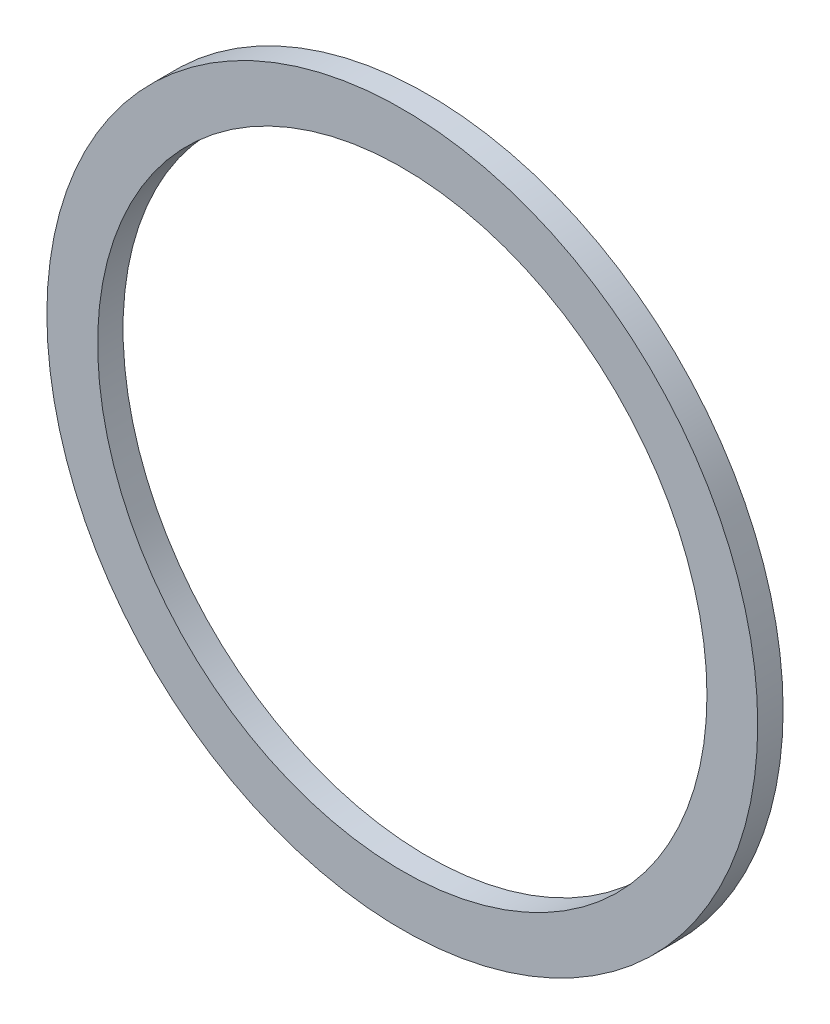
ISO-10303-21;
HEADER;
FILE_DESCRIPTION(('STEP AP214'),'2;1');
FILE_NAME('part.step','',(''),(''),'','','');
FILE_SCHEMA(('AUTOMOTIVE_DESIGN { 1 0 10303 214 1 1 1 1 }'));
ENDSEC;
DATA;
#1=APPLICATION_CONTEXT('core data for automotive mechanical design processes');
#2=APPLICATION_PROTOCOL_DEFINITION('international standard','automotive_design',2000,#1);
#3=PRODUCT_CONTEXT('',#1,'mechanical');
#4=PRODUCT('Part','Part','',(#3));
#5=PRODUCT_RELATED_PRODUCT_CATEGORY('part','',(#4));
#6=PRODUCT_DEFINITION_FORMATION('','',#4);
#7=PRODUCT_DEFINITION_CONTEXT('part definition',#1,'design');
#8=PRODUCT_DEFINITION('design','',#6,#7);
#9=PRODUCT_DEFINITION_SHAPE('','',#8);
#10=(LENGTH_UNIT() NAMED_UNIT(*) SI_UNIT(.MILLI.,.METRE.));
#11=(NAMED_UNIT(*) PLANE_ANGLE_UNIT() SI_UNIT($,.RADIAN.));
#12=(NAMED_UNIT(*) SI_UNIT($,.STERADIAN.) SOLID_ANGLE_UNIT());
#13=UNCERTAINTY_MEASURE_WITH_UNIT(LENGTH_MEASURE(1.E-05),#10,'distance_accuracy_value','');
#14=(GEOMETRIC_REPRESENTATION_CONTEXT(3) GLOBAL_UNCERTAINTY_ASSIGNED_CONTEXT((#13)) GLOBAL_UNIT_ASSIGNED_CONTEXT((#10,
#11,#12)) REPRESENTATION_CONTEXT('',''));
#15=CARTESIAN_POINT('',(0.,0.,0.));
#16=DIRECTION('',(0.,0.,1.));
#17=DIRECTION('',(1.,0.,0.));
#18=AXIS2_PLACEMENT_3D('',#15,#16,#17);
#19=CARTESIAN_POINT('',(-0.0999587239789712,0.399834895915926,2.5));
#20=DIRECTION('',(0.,0.,1.));
#21=DIRECTION('',(1.,0.,0.));
#22=AXIS2_PLACEMENT_3D('',#19,#20,#21);
#23=PLANE('',#22);
#24=CARTESIAN_POINT('',(-0.0999587239789712,0.399834895915926,2.5));
#25=DIRECTION('',(0.,0.,1.));
#26=DIRECTION('',(1.,0.,0.));
#27=AXIS2_PLACEMENT_3D('',#24,#25,#26);
#28=CIRCLE('',#27,35.);
#29=CARTESIAN_POINT('',(34.900041276021,0.399834895915926,2.5));
#30=VERTEX_POINT('',#29);
#31=EDGE_CURVE('E10',#30,#30,#28,.T.);
#32=ORIENTED_EDGE('',*,*,#31,.T.);
#33=EDGE_LOOP('',(#32));
#34=FACE_BOUND('',#33,.T.);
#35=CARTESIAN_POINT('',(-0.0999587239789712,0.399834895915926,2.5));
#36=DIRECTION('',(0.,0.,1.));
#37=DIRECTION('',(1.,0.,0.));
#38=AXIS2_PLACEMENT_3D('',#35,#36,#37);
#39=CIRCLE('',#38,30.);
#40=CARTESIAN_POINT('',(29.900041276021,0.399834895915926,2.5));
#41=VERTEX_POINT('',#40);
#42=EDGE_CURVE('E50',#41,#41,#39,.T.);
#43=ORIENTED_EDGE('',*,*,#42,.F.);
#44=EDGE_LOOP('',(#43));
#45=FACE_BOUND('',#44,.T.);
#46=ADVANCED_FACE('F37',(#34,#45),#23,.T.);
#47=CARTESIAN_POINT('',(-0.0999587239789712,0.399834895915926,0.));
#48=DIRECTION('',(0.,0.,1.));
#49=DIRECTION('',(1.,0.,0.));
#50=AXIS2_PLACEMENT_3D('',#47,#48,#49);
#51=PLANE('',#50);
#52=CARTESIAN_POINT('',(-0.0999587239789712,0.399834895915926,0.));
#53=DIRECTION('',(0.,0.,1.));
#54=DIRECTION('',(1.,0.,0.));
#55=AXIS2_PLACEMENT_3D('',#52,#53,#54);
#56=CIRCLE('',#55,35.);
#57=CARTESIAN_POINT('',(34.900041276021,0.399834895915926,0.));
#58=VERTEX_POINT('',#57);
#59=EDGE_CURVE('E41',#58,#58,#56,.T.);
#60=ORIENTED_EDGE('',*,*,#59,.F.);
#61=EDGE_LOOP('',(#60));
#62=FACE_BOUND('',#61,.T.);
#63=CARTESIAN_POINT('',(-0.0999587239789712,0.399834895915926,0.));
#64=DIRECTION('',(0.,0.,1.));
#65=DIRECTION('',(1.,0.,0.));
#66=AXIS2_PLACEMENT_3D('',#63,#64,#65);
#67=CIRCLE('',#66,30.);
#68=CARTESIAN_POINT('',(29.900041276021,0.399834895915926,0.));
#69=VERTEX_POINT('',#68);
#70=EDGE_CURVE('E52',#69,#69,#67,.T.);
#71=ORIENTED_EDGE('',*,*,#70,.T.);
#72=EDGE_LOOP('',(#71));
#73=FACE_BOUND('',#72,.T.);
#74=ADVANCED_FACE('F64',(#62,#73),#51,.F.);
#75=CARTESIAN_POINT('',(-0.0999587239789712,0.399834895915926,2.5));
#76=DIRECTION('',(0.,0.,-1.));
#77=DIRECTION('',(-1.,0.,0.));
#78=AXIS2_PLACEMENT_3D('',#75,#76,#77);
#79=CYLINDRICAL_SURFACE('',#78,35.);
#80=ORIENTED_EDGE('',*,*,#31,.F.);
#81=EDGE_LOOP('',(#80));
#82=FACE_BOUND('',#81,.T.);
#83=ORIENTED_EDGE('',*,*,#59,.T.);
#84=EDGE_LOOP('',(#83));
#85=FACE_BOUND('',#84,.T.);
#86=ADVANCED_FACE('F39',(#82,#85),#79,.T.);
#87=CARTESIAN_POINT('',(-0.0999587239789712,0.399834895915926,2.5));
#88=DIRECTION('',(0.,0.,-1.));
#89=DIRECTION('',(-1.,0.,0.));
#90=AXIS2_PLACEMENT_3D('',#87,#88,#89);
#91=CYLINDRICAL_SURFACE('',#90,30.);
#92=ORIENTED_EDGE('',*,*,#42,.T.);
#93=EDGE_LOOP('',(#92));
#94=FACE_BOUND('',#93,.T.);
#95=ORIENTED_EDGE('',*,*,#70,.F.);
#96=EDGE_LOOP('',(#95));
#97=FACE_BOUND('',#96,.T.);
#98=ADVANCED_FACE('F60',(#94,#97),#91,.F.);
#99=CLOSED_SHELL('',(#46,#74,#86,#98));
#100=MANIFOLD_SOLID_BREP('B2',#99);
#101=ADVANCED_BREP_SHAPE_REPRESENTATION('',(#18,#100),#14);
#102=SHAPE_DEFINITION_REPRESENTATION(#9,#101);
ENDSEC;
END-ISO-10303-21;
